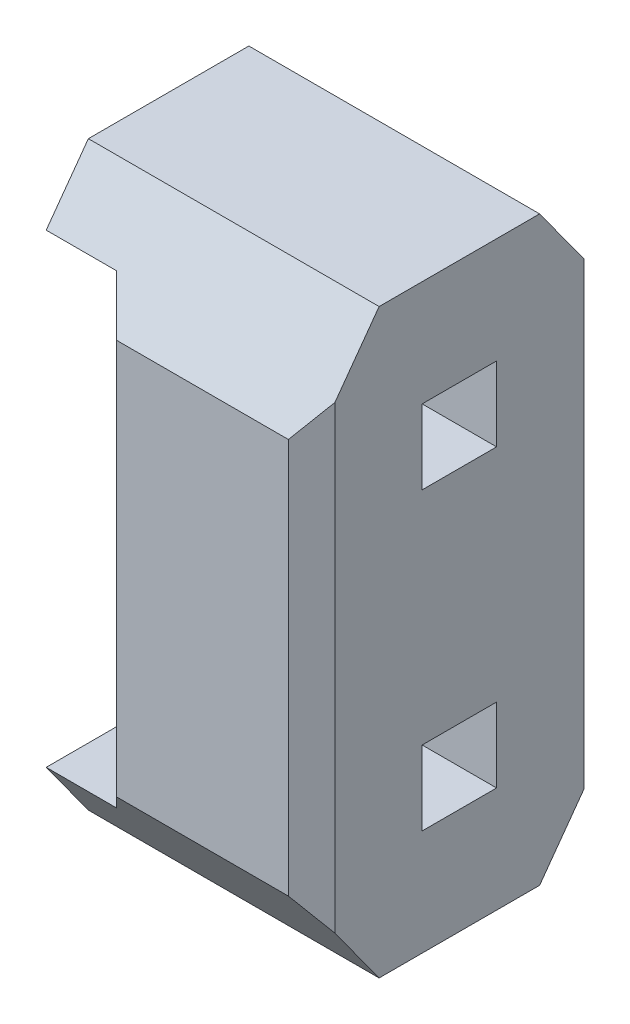
ISO-10303-21;
HEADER;
FILE_DESCRIPTION(('STEP AP214'),'2;1');
FILE_NAME('part.step','',(''),(''),'','','');
FILE_SCHEMA(('AUTOMOTIVE_DESIGN { 1 0 10303 214 1 1 1 1 }'));
ENDSEC;
DATA;
#1=APPLICATION_CONTEXT('core data for automotive mechanical design processes');
#2=APPLICATION_PROTOCOL_DEFINITION('international standard','automotive_design',2000,#1);
#3=PRODUCT_CONTEXT('',#1,'mechanical');
#4=PRODUCT('Part','Part','',(#3));
#5=PRODUCT_RELATED_PRODUCT_CATEGORY('part','',(#4));
#6=PRODUCT_DEFINITION_FORMATION('','',#4);
#7=PRODUCT_DEFINITION_CONTEXT('part definition',#1,'design');
#8=PRODUCT_DEFINITION('design','',#6,#7);
#9=PRODUCT_DEFINITION_SHAPE('','',#8);
#10=(LENGTH_UNIT() NAMED_UNIT(*) SI_UNIT(.MILLI.,.METRE.));
#11=(NAMED_UNIT(*) PLANE_ANGLE_UNIT() SI_UNIT($,.RADIAN.));
#12=(NAMED_UNIT(*) SI_UNIT($,.STERADIAN.) SOLID_ANGLE_UNIT());
#13=UNCERTAINTY_MEASURE_WITH_UNIT(LENGTH_MEASURE(1.E-05),#10,'distance_accuracy_value','');
#14=(GEOMETRIC_REPRESENTATION_CONTEXT(3) GLOBAL_UNCERTAINTY_ASSIGNED_CONTEXT((#13)) GLOBAL_UNIT_ASSIGNED_CONTEXT((#10,
#11,#12)) REPRESENTATION_CONTEXT('',''));
#15=CARTESIAN_POINT('',(0.,0.,0.));
#16=DIRECTION('',(0.,0.,1.));
#17=DIRECTION('',(1.,0.,0.));
#18=AXIS2_PLACEMENT_3D('',#15,#16,#17);
#19=CARTESIAN_POINT('',(1.25,4.6,-15.53));
#20=DIRECTION('',(0.,0.586967571460905,0.809610443394407));
#21=DIRECTION('',(0.,-0.809610443394407,0.586967571460905));
#22=AXIS2_PLACEMENT_3D('',#19,#20,#21);
#23=PLANE('',#22);
#24=DIRECTION('',(1.,0.,0.));
#25=VECTOR('',#24,1.);
#26=CARTESIAN_POINT('',(1.25,4.5,-15.4575));
#27=LINE('',#26,#25);
#28=CARTESIAN_POINT('',(0.,4.5,-15.4575));
#29=VERTEX_POINT('',#28);
#30=CARTESIAN_POINT('',(0.602500000000325,4.5,-15.4575000000001));
#31=VERTEX_POINT('',#30);
#32=EDGE_CURVE('E199',#29,#31,#27,.T.);
#33=ORIENTED_EDGE('',*,*,#32,.T.);
#34=DIRECTION('',(0.506207656348696,-0.698217457033983,0.506207656349604));
#35=VECTOR('',#34,1.);
#36=CARTESIAN_POINT('',(0.6025000000002,4.5,-15.4575));
#37=LINE('',#36,#35);
#38=CARTESIAN_POINT('',(0.819999999999671,4.2,-15.2399999999999));
#39=VERTEX_POINT('',#38);
#40=EDGE_CURVE('E197',#31,#39,#37,.T.);
#41=ORIENTED_EDGE('',*,*,#40,.T.);
#42=DIRECTION('',(1.,0.,0.));
#43=VECTOR('',#42,1.);
#44=CARTESIAN_POINT('',(1.25,4.19999999999999,-15.24));
#45=LINE('',#44,#43);
#46=CARTESIAN_POINT('',(2.30000000000012,4.2,-15.2399999999999));
#47=VERTEX_POINT('',#46);
#48=EDGE_CURVE('E20',#39,#47,#45,.T.);
#49=ORIENTED_EDGE('',*,*,#48,.T.);
#50=DIRECTION('',(0.506207656348956,0.698217457033859,-0.506207656349515));
#51=VECTOR('',#50,1.);
#52=CARTESIAN_POINT('',(2.3,4.19999999999999,-15.24));
#53=LINE('',#52,#51);
#54=CARTESIAN_POINT('',(2.49999999999988,4.47586206896591,-15.4400000000002));
#55=VERTEX_POINT('',#54);
#56=EDGE_CURVE('E181',#47,#55,#53,.T.);
#57=ORIENTED_EDGE('',*,*,#56,.T.);
#58=DIRECTION('',(0.,-0.809610443394407,0.586967571460905));
#59=VECTOR('',#58,1.);
#60=CARTESIAN_POINT('',(2.5,4.6,-15.53));
#61=LINE('',#60,#59);
#62=CARTESIAN_POINT('',(2.5,5.,-15.82));
#63=VERTEX_POINT('',#62);
#64=EDGE_CURVE('E188',#55,#63,#61,.F.);
#65=ORIENTED_EDGE('',*,*,#64,.T.);
#66=DIRECTION('',(1.,0.,0.));
#67=VECTOR('',#66,1.);
#68=CARTESIAN_POINT('',(1.25,5.,-15.82));
#69=LINE('',#68,#67);
#70=CARTESIAN_POINT('',(0.,5.,-15.82));
#71=VERTEX_POINT('',#70);
#72=EDGE_CURVE('E215',#71,#63,#69,.T.);
#73=ORIENTED_EDGE('',*,*,#72,.F.);
#74=DIRECTION('',(0.,-0.809610443394407,0.586967571460905));
#75=VECTOR('',#74,1.);
#76=CARTESIAN_POINT('',(0.,4.6,-15.53));
#77=LINE('',#76,#75);
#78=EDGE_CURVE('E207',#71,#29,#77,.T.);
#79=ORIENTED_EDGE('',*,*,#78,.T.);
#80=EDGE_LOOP('',(#33,#41,#49,#57,#65,#73,#79));
#81=FACE_BOUND('',#80,.T.);
#82=ADVANCED_FACE('F17',(#81),#23,.T.);
#83=CARTESIAN_POINT('',(1.25,4.6,-17.49));
#84=DIRECTION('',(0.,-0.586967571460905,0.809610443394407));
#85=DIRECTION('',(0.,-0.809610443394407,-0.586967571460905));
#86=AXIS2_PLACEMENT_3D('',#83,#84,#85);
#87=PLANE('',#86);
#88=DIRECTION('',(0.,-0.809610443394407,-0.586967571460905));
#89=VECTOR('',#88,1.);
#90=CARTESIAN_POINT('',(0.,4.6,-17.49));
#91=LINE('',#90,#89);
#92=CARTESIAN_POINT('',(0.,5.,-17.2));
#93=VERTEX_POINT('',#92);
#94=CARTESIAN_POINT('',(0.,4.5,-17.5625));
#95=VERTEX_POINT('',#94);
#96=EDGE_CURVE('E263',#93,#95,#91,.T.);
#97=ORIENTED_EDGE('',*,*,#96,.F.);
#98=DIRECTION('',(1.,0.,0.));
#99=VECTOR('',#98,1.);
#100=CARTESIAN_POINT('',(1.25,5.,-17.2));
#101=LINE('',#100,#99);
#102=CARTESIAN_POINT('',(2.5,5.,-17.2));
#103=VERTEX_POINT('',#102);
#104=EDGE_CURVE('E227',#103,#93,#101,.F.);
#105=ORIENTED_EDGE('',*,*,#104,.F.);
#106=DIRECTION('',(0.,-0.809610443394407,-0.586967571460905));
#107=VECTOR('',#106,1.);
#108=CARTESIAN_POINT('',(2.5,4.6,-17.49));
#109=LINE('',#108,#107);
#110=CARTESIAN_POINT('',(2.49999999999988,4.47586206896591,-17.5799999999998));
#111=VERTEX_POINT('',#110);
#112=EDGE_CURVE('E223',#111,#103,#109,.F.);
#113=ORIENTED_EDGE('',*,*,#112,.F.);
#114=DIRECTION('',(0.506207656348955,0.69821745703386,0.506207656349514));
#115=VECTOR('',#114,1.);
#116=CARTESIAN_POINT('',(2.3,4.19999999999999,-17.78));
#117=LINE('',#116,#115);
#118=CARTESIAN_POINT('',(2.30000000000012,4.2,-17.7800000000001));
#119=VERTEX_POINT('',#118);
#120=EDGE_CURVE('E266',#119,#111,#117,.T.);
#121=ORIENTED_EDGE('',*,*,#120,.F.);
#122=DIRECTION('',(1.,0.,0.));
#123=VECTOR('',#122,1.);
#124=CARTESIAN_POINT('',(1.25,4.19999999999999,-17.78));
#125=LINE('',#124,#123);
#126=CARTESIAN_POINT('',(0.819999999999671,4.2,-17.7800000000001));
#127=VERTEX_POINT('',#126);
#128=EDGE_CURVE('E205',#127,#119,#125,.T.);
#129=ORIENTED_EDGE('',*,*,#128,.F.);
#130=DIRECTION('',(0.506207656348694,-0.698217457033983,-0.506207656349606));
#131=VECTOR('',#130,1.);
#132=CARTESIAN_POINT('',(0.6025000000002,4.5,-17.5625));
#133=LINE('',#132,#131);
#134=CARTESIAN_POINT('',(0.602500000000325,4.5,-17.5624999999999));
#135=VERTEX_POINT('',#134);
#136=EDGE_CURVE('E203',#135,#127,#133,.T.);
#137=ORIENTED_EDGE('',*,*,#136,.F.);
#138=DIRECTION('',(1.,0.,0.));
#139=VECTOR('',#138,1.);
#140=CARTESIAN_POINT('',(1.25,4.5,-17.5625));
#141=LINE('',#140,#139);
#142=EDGE_CURVE('E261',#95,#135,#141,.T.);
#143=ORIENTED_EDGE('',*,*,#142,.F.);
#144=EDGE_LOOP('',(#97,#105,#113,#121,#129,#137,#143));
#145=FACE_BOUND('',#144,.T.);
#146=ADVANCED_FACE('F285',(#145),#87,.F.);
#147=CARTESIAN_POINT('',(1.25,0.4,-17.49));
#148=DIRECTION('',(0.,0.586967571460905,0.809610443394407));
#149=DIRECTION('',(0.,-0.809610443394407,0.586967571460905));
#150=AXIS2_PLACEMENT_3D('',#147,#148,#149);
#151=PLANE('',#150);
#152=DIRECTION('',(-0.5062076563494,0.698217457033648,-0.506207656349362));
#153=VECTOR('',#152,1.);
#154=CARTESIAN_POINT('',(2.5,0.524137931034496,-17.58));
#155=LINE('',#154,#153);
#156=CARTESIAN_POINT('',(2.49999999999988,0.524137931034498,-17.5799999999999));
#157=VERTEX_POINT('',#156);
#158=CARTESIAN_POINT('',(2.30000000000012,0.800000000000005,-17.7800000000001));
#159=VERTEX_POINT('',#158);
#160=EDGE_CURVE('E251',#157,#159,#155,.T.);
#161=ORIENTED_EDGE('',*,*,#160,.F.);
#162=DIRECTION('',(0.,-0.809610443394407,0.586967571460905));
#163=VECTOR('',#162,1.);
#164=CARTESIAN_POINT('',(2.5,0.4,-17.49));
#165=LINE('',#164,#163);
#166=CARTESIAN_POINT('',(2.5,0.,-17.2));
#167=VERTEX_POINT('',#166);
#168=EDGE_CURVE('E253',#167,#157,#165,.F.);
#169=ORIENTED_EDGE('',*,*,#168,.F.);
#170=DIRECTION('',(1.,0.,0.));
#171=VECTOR('',#170,1.);
#172=CARTESIAN_POINT('',(1.25,0.,-17.2));
#173=LINE('',#172,#171);
#174=CARTESIAN_POINT('',(0.,0.,-17.2));
#175=VERTEX_POINT('',#174);
#176=EDGE_CURVE('E288',#167,#175,#173,.F.);
#177=ORIENTED_EDGE('',*,*,#176,.T.);
#178=DIRECTION('',(0.,-0.809610443394407,0.586967571460905));
#179=VECTOR('',#178,1.);
#180=CARTESIAN_POINT('',(0.,0.4,-17.49));
#181=LINE('',#180,#179);
#182=CARTESIAN_POINT('',(0.,0.500000000000001,-17.5625));
#183=VERTEX_POINT('',#182);
#184=EDGE_CURVE('E255',#183,#175,#181,.T.);
#185=ORIENTED_EDGE('',*,*,#184,.F.);
#186=DIRECTION('',(1.,0.,0.));
#187=VECTOR('',#186,1.);
#188=CARTESIAN_POINT('',(1.25,0.500000000000003,-17.5625));
#189=LINE('',#188,#187);
#190=CARTESIAN_POINT('',(0.602500000000325,0.500000000000002,-17.5624999999999));
#191=VERTEX_POINT('',#190);
#192=EDGE_CURVE('E257',#191,#183,#189,.F.);
#193=ORIENTED_EDGE('',*,*,#192,.F.);
#194=DIRECTION('',(-0.506207656348694,-0.698217457033983,0.506207656349606));
#195=VECTOR('',#194,1.);
#196=CARTESIAN_POINT('',(0.8199999999998,0.800000000000011,-17.78));
#197=LINE('',#196,#195);
#198=CARTESIAN_POINT('',(0.819999999999671,0.800000000000005,-17.7800000000001));
#199=VERTEX_POINT('',#198);
#200=EDGE_CURVE('E259',#199,#191,#197,.T.);
#201=ORIENTED_EDGE('',*,*,#200,.F.);
#202=DIRECTION('',(1.,0.,0.));
#203=VECTOR('',#202,1.);
#204=CARTESIAN_POINT('',(1.25,0.800000000000011,-17.78));
#205=LINE('',#204,#203);
#206=EDGE_CURVE('E249',#159,#199,#205,.F.);
#207=ORIENTED_EDGE('',*,*,#206,.F.);
#208=EDGE_LOOP('',(#161,#169,#177,#185,#193,#201,#207));
#209=FACE_BOUND('',#208,.T.);
#210=ADVANCED_FACE('F431',(#209),#151,.F.);
#211=CARTESIAN_POINT('',(1.25,0.4,-15.53));
#212=DIRECTION('',(0.,-0.586967571460905,0.809610443394407));
#213=DIRECTION('',(0.,-0.809610443394407,-0.586967571460905));
#214=AXIS2_PLACEMENT_3D('',#211,#212,#213);
#215=PLANE('',#214);
#216=DIRECTION('',(1.,0.,0.));
#217=VECTOR('',#216,1.);
#218=CARTESIAN_POINT('',(1.25,0.800000000000009,-15.24));
#219=LINE('',#218,#217);
#220=CARTESIAN_POINT('',(2.30000000000012,0.800000000000005,-15.2399999999999));
#221=VERTEX_POINT('',#220);
#222=CARTESIAN_POINT('',(0.819999999999671,0.800000000000004,-15.2399999999999));
#223=VERTEX_POINT('',#222);
#224=EDGE_CURVE('E191',#221,#223,#219,.F.);
#225=ORIENTED_EDGE('',*,*,#224,.T.);
#226=DIRECTION('',(-0.506207656348695,-0.698217457033984,-0.506207656349603));
#227=VECTOR('',#226,1.);
#228=CARTESIAN_POINT('',(0.8199999999998,0.800000000000009,-15.24));
#229=LINE('',#228,#227);
#230=CARTESIAN_POINT('',(0.602500000000325,0.500000000000001,-15.4575000000001));
#231=VERTEX_POINT('',#230);
#232=EDGE_CURVE('E232',#223,#231,#229,.T.);
#233=ORIENTED_EDGE('',*,*,#232,.T.);
#234=DIRECTION('',(1.,0.,0.));
#235=VECTOR('',#234,1.);
#236=CARTESIAN_POINT('',(1.25,0.500000000000002,-15.4575));
#237=LINE('',#236,#235);
#238=CARTESIAN_POINT('',(0.,0.500000000000001,-15.4575));
#239=VERTEX_POINT('',#238);
#240=EDGE_CURVE('E246',#231,#239,#237,.F.);
#241=ORIENTED_EDGE('',*,*,#240,.T.);
#242=DIRECTION('',(0.,-0.809610443394407,-0.586967571460905));
#243=VECTOR('',#242,1.);
#244=CARTESIAN_POINT('',(0.,0.4,-15.53));
#245=LINE('',#244,#243);
#246=CARTESIAN_POINT('',(0.,0.,-15.82));
#247=VERTEX_POINT('',#246);
#248=EDGE_CURVE('E244',#239,#247,#245,.T.);
#249=ORIENTED_EDGE('',*,*,#248,.T.);
#250=DIRECTION('',(1.,0.,0.));
#251=VECTOR('',#250,1.);
#252=CARTESIAN_POINT('',(1.25,0.,-15.82));
#253=LINE('',#252,#251);
#254=CARTESIAN_POINT('',(2.5,0.,-15.82));
#255=VERTEX_POINT('',#254);
#256=EDGE_CURVE('E293',#247,#255,#253,.T.);
#257=ORIENTED_EDGE('',*,*,#256,.T.);
#258=DIRECTION('',(0.,-0.809610443394407,-0.586967571460905));
#259=VECTOR('',#258,1.);
#260=CARTESIAN_POINT('',(2.5,0.4,-15.53));
#261=LINE('',#260,#259);
#262=CARTESIAN_POINT('',(2.49999999999988,0.524137931034498,-15.4400000000001));
#263=VERTEX_POINT('',#262);
#264=EDGE_CURVE('E241',#255,#263,#261,.F.);
#265=ORIENTED_EDGE('',*,*,#264,.T.);
#266=DIRECTION('',(-0.506207656349403,0.698217457033647,0.50620765634936));
#267=VECTOR('',#266,1.);
#268=CARTESIAN_POINT('',(2.5,0.524137931034496,-15.44));
#269=LINE('',#268,#267);
#270=EDGE_CURVE('E239',#263,#221,#269,.T.);
#271=ORIENTED_EDGE('',*,*,#270,.T.);
#272=EDGE_LOOP('',(#225,#233,#241,#249,#257,#265,#271));
#273=FACE_BOUND('',#272,.T.);
#274=ADVANCED_FACE('F421',(#273),#215,.T.);
#275=CARTESIAN_POINT('',(1.25,5.,-16.51));
#276=DIRECTION('',(0.,1.,0.));
#277=DIRECTION('',(0.,0.,1.));
#278=AXIS2_PLACEMENT_3D('',#275,#276,#277);
#279=PLANE('',#278);
#280=ORIENTED_EDGE('',*,*,#104,.T.);
#281=DIRECTION('',(0.,0.,-1.));
#282=VECTOR('',#281,1.);
#283=CARTESIAN_POINT('',(0.,5.,-16.51));
#284=LINE('',#283,#282);
#285=EDGE_CURVE('E231',#93,#71,#284,.F.);
#286=ORIENTED_EDGE('',*,*,#285,.T.);
#287=ORIENTED_EDGE('',*,*,#72,.T.);
#288=DIRECTION('',(0.,0.,1.));
#289=VECTOR('',#288,1.);
#290=CARTESIAN_POINT('',(2.5,5.,-16.51));
#291=LINE('',#290,#289);
#292=EDGE_CURVE('E219',#63,#103,#291,.F.);
#293=ORIENTED_EDGE('',*,*,#292,.T.);
#294=EDGE_LOOP('',(#280,#286,#287,#293));
#295=FACE_BOUND('',#294,.T.);
#296=ADVANCED_FACE('F229',(#295),#279,.T.);
#297=CARTESIAN_POINT('',(1.25,0.,-16.51));
#298=DIRECTION('',(0.,1.,0.));
#299=DIRECTION('',(0.,0.,1.));
#300=AXIS2_PLACEMENT_3D('',#297,#298,#299);
#301=PLANE('',#300);
#302=DIRECTION('',(0.,0.,-1.));
#303=VECTOR('',#302,1.);
#304=CARTESIAN_POINT('',(0.,0.,-16.51));
#305=LINE('',#304,#303);
#306=EDGE_CURVE('E297',#247,#175,#305,.T.);
#307=ORIENTED_EDGE('',*,*,#306,.T.);
#308=ORIENTED_EDGE('',*,*,#176,.F.);
#309=DIRECTION('',(0.,0.,1.));
#310=VECTOR('',#309,1.);
#311=CARTESIAN_POINT('',(2.5,0.,-16.51));
#312=LINE('',#311,#310);
#313=EDGE_CURVE('E287',#255,#167,#312,.F.);
#314=ORIENTED_EDGE('',*,*,#313,.F.);
#315=ORIENTED_EDGE('',*,*,#256,.F.);
#316=EDGE_LOOP('',(#307,#308,#314,#315));
#317=FACE_BOUND('',#316,.T.);
#318=ADVANCED_FACE('F428',(#317),#301,.F.);
#319=CARTESIAN_POINT('',(0.,4.75,-16.51));
#320=DIRECTION('',(1.,0.,0.));
#321=DIRECTION('',(0.,0.,-1.));
#322=AXIS2_PLACEMENT_3D('',#319,#320,#321);
#323=PLANE('',#322);
#324=ORIENTED_EDGE('',*,*,#285,.F.);
#325=ORIENTED_EDGE('',*,*,#96,.T.);
#326=DIRECTION('',(0.,0.,1.));
#327=VECTOR('',#326,1.);
#328=CARTESIAN_POINT('',(0.,4.5,-16.51));
#329=LINE('',#328,#327);
#330=EDGE_CURVE('E307',#95,#29,#329,.T.);
#331=ORIENTED_EDGE('',*,*,#330,.T.);
#332=ORIENTED_EDGE('',*,*,#78,.F.);
#333=EDGE_LOOP('',(#324,#325,#331,#332));
#334=FACE_BOUND('',#333,.T.);
#335=ADVANCED_FACE('F441',(#334),#323,.F.);
#336=CARTESIAN_POINT('',(0.,0.25,-16.51));
#337=DIRECTION('',(1.,0.,0.));
#338=DIRECTION('',(0.,0.,-1.));
#339=AXIS2_PLACEMENT_3D('',#336,#337,#338);
#340=PLANE('',#339);
#341=ORIENTED_EDGE('',*,*,#306,.F.);
#342=ORIENTED_EDGE('',*,*,#248,.F.);
#343=DIRECTION('',(0.,0.,1.));
#344=VECTOR('',#343,1.);
#345=CARTESIAN_POINT('',(0.,0.5,-16.51));
#346=LINE('',#345,#344);
#347=EDGE_CURVE('E315',#183,#239,#346,.T.);
#348=ORIENTED_EDGE('',*,*,#347,.F.);
#349=ORIENTED_EDGE('',*,*,#184,.T.);
#350=EDGE_LOOP('',(#341,#342,#348,#349));
#351=FACE_BOUND('',#350,.T.);
#352=ADVANCED_FACE('F443',(#351),#340,.F.);
#353=CARTESIAN_POINT('',(1.55,3.45,-16.51));
#354=DIRECTION('',(0.,1.,0.));
#355=DIRECTION('',(0.,0.,1.));
#356=AXIS2_PLACEMENT_3D('',#353,#354,#355);
#357=PLANE('',#356);
#358=DIRECTION('',(1.,0.,0.));
#359=VECTOR('',#358,1.);
#360=CARTESIAN_POINT('',(1.55,3.45,-16.83));
#361=LINE('',#360,#359);
#362=CARTESIAN_POINT('',(0.6,3.45,-16.83));
#363=VERTEX_POINT('',#362);
#364=CARTESIAN_POINT('',(2.5,3.45,-16.83));
#365=VERTEX_POINT('',#364);
#366=EDGE_CURVE('E332',#363,#365,#361,.T.);
#367=ORIENTED_EDGE('',*,*,#366,.F.);
#368=DIRECTION('',(0.,0.,1.));
#369=VECTOR('',#368,1.);
#370=CARTESIAN_POINT('',(0.6,3.45,-16.51));
#371=LINE('',#370,#369);
#372=CARTESIAN_POINT('',(0.6,3.45,-16.19));
#373=VERTEX_POINT('',#372);
#374=EDGE_CURVE('E302',#363,#373,#371,.T.);
#375=ORIENTED_EDGE('',*,*,#374,.T.);
#376=DIRECTION('',(1.,0.,0.));
#377=VECTOR('',#376,1.);
#378=CARTESIAN_POINT('',(1.55,3.45,-16.19));
#379=LINE('',#378,#377);
#380=CARTESIAN_POINT('',(2.5,3.45,-16.19));
#381=VERTEX_POINT('',#380);
#382=EDGE_CURVE('E327',#373,#381,#379,.T.);
#383=ORIENTED_EDGE('',*,*,#382,.T.);
#384=DIRECTION('',(0.,0.,1.));
#385=VECTOR('',#384,1.);
#386=CARTESIAN_POINT('',(2.5,3.45,-16.51));
#387=LINE('',#386,#385);
#388=EDGE_CURVE('E300',#381,#365,#387,.F.);
#389=ORIENTED_EDGE('',*,*,#388,.T.);
#390=EDGE_LOOP('',(#367,#375,#383,#389));
#391=FACE_BOUND('',#390,.T.);
#392=ADVANCED_FACE('F398',(#391),#357,.T.);
#393=CARTESIAN_POINT('',(0.71,2.5,-17.67));
#394=DIRECTION('',(0.707106781190498,0.,0.707106781182598));
#395=DIRECTION('',(0.707106781182598,0.,-0.707106781190498));
#396=AXIS2_PLACEMENT_3D('',#393,#394,#395);
#397=PLANE('',#396);
#398=ORIENTED_EDGE('',*,*,#200,.T.);
#399=DIRECTION('',(0.70710678118618,0.,-0.707106781186916));
#400=VECTOR('',#399,1.);
#401=CARTESIAN_POINT('',(0.6000000000002,0.5,-17.56));
#402=LINE('',#401,#400);
#403=CARTESIAN_POINT('',(0.600000000000407,0.5,-17.5599999999997));
#404=VERTEX_POINT('',#403);
#405=EDGE_CURVE('E312',#404,#191,#402,.T.);
#406=ORIENTED_EDGE('',*,*,#405,.F.);
#407=DIRECTION('',(0.,1.,0.));
#408=VECTOR('',#407,1.);
#409=CARTESIAN_POINT('',(0.6,2.5,-17.56));
#410=LINE('',#409,#408);
#411=CARTESIAN_POINT('',(0.600000000000407,4.5,-17.5599999999997));
#412=VERTEX_POINT('',#411);
#413=EDGE_CURVE('E337',#404,#412,#410,.T.);
#414=ORIENTED_EDGE('',*,*,#413,.T.);
#415=DIRECTION('',(0.70710678118618,0.,-0.707106781186916));
#416=VECTOR('',#415,1.);
#417=CARTESIAN_POINT('',(0.6000000000002,4.5,-17.56));
#418=LINE('',#417,#416);
#419=EDGE_CURVE('E304',#412,#135,#418,.T.);
#420=ORIENTED_EDGE('',*,*,#419,.T.);
#421=ORIENTED_EDGE('',*,*,#136,.T.);
#422=DIRECTION('',(0.,1.,0.));
#423=VECTOR('',#422,1.);
#424=CARTESIAN_POINT('',(0.8199999999998,2.5,-17.78));
#425=LINE('',#424,#423);
#426=EDGE_CURVE('E275',#127,#199,#425,.F.);
#427=ORIENTED_EDGE('',*,*,#426,.T.);
#428=EDGE_LOOP('',(#398,#406,#414,#420,#421,#427));
#429=FACE_BOUND('',#428,.T.);
#430=ADVANCED_FACE('F435',(#429),#397,.F.);
#431=CARTESIAN_POINT('',(0.30125,4.5,-16.51));
#432=DIRECTION('',(0.,1.,0.));
#433=DIRECTION('',(0.,0.,1.));
#434=AXIS2_PLACEMENT_3D('',#431,#432,#433);
#435=PLANE('',#434);
#436=ORIENTED_EDGE('',*,*,#142,.T.);
#437=ORIENTED_EDGE('',*,*,#419,.F.);
#438=DIRECTION('',(0.,0.,-1.));
#439=VECTOR('',#438,1.);
#440=CARTESIAN_POINT('',(0.6,4.5,-16.51));
#441=LINE('',#440,#439);
#442=CARTESIAN_POINT('',(0.600000000000279,4.5,-15.4600000000001));
#443=VERTEX_POINT('',#442);
#444=EDGE_CURVE('E339',#412,#443,#441,.F.);
#445=ORIENTED_EDGE('',*,*,#444,.T.);
#446=DIRECTION('',(-0.707106781182598,0.,-0.707106781190498));
#447=VECTOR('',#446,1.);
#448=CARTESIAN_POINT('',(0.71,4.5,-15.35));
#449=LINE('',#448,#447);
#450=EDGE_CURVE('E310',#443,#31,#449,.F.);
#451=ORIENTED_EDGE('',*,*,#450,.T.);
#452=ORIENTED_EDGE('',*,*,#32,.F.);
#453=ORIENTED_EDGE('',*,*,#330,.F.);
#454=EDGE_LOOP('',(#436,#437,#445,#451,#452,#453));
#455=FACE_BOUND('',#454,.T.);
#456=ADVANCED_FACE('F439',(#455),#435,.F.);
#457=CARTESIAN_POINT('',(0.71,2.5,-15.35));
#458=DIRECTION('',(0.707106781190498,0.,-0.707106781182598));
#459=DIRECTION('',(-0.707106781182598,0.,-0.707106781190498));
#460=AXIS2_PLACEMENT_3D('',#457,#458,#459);
#461=PLANE('',#460);
#462=ORIENTED_EDGE('',*,*,#232,.F.);
#463=DIRECTION('',(0.,1.,0.));
#464=VECTOR('',#463,1.);
#465=CARTESIAN_POINT('',(0.8199999999998,2.5,-15.24));
#466=LINE('',#465,#464);
#467=EDGE_CURVE('E325',#39,#223,#466,.F.);
#468=ORIENTED_EDGE('',*,*,#467,.F.);
#469=ORIENTED_EDGE('',*,*,#40,.F.);
#470=ORIENTED_EDGE('',*,*,#450,.F.);
#471=DIRECTION('',(0.,1.,0.));
#472=VECTOR('',#471,1.);
#473=CARTESIAN_POINT('',(0.6,2.5,-15.46));
#474=LINE('',#473,#472);
#475=CARTESIAN_POINT('',(0.600000000000407,0.5,-15.4600000000003));
#476=VERTEX_POINT('',#475);
#477=EDGE_CURVE('E341',#443,#476,#474,.F.);
#478=ORIENTED_EDGE('',*,*,#477,.T.);
#479=DIRECTION('',(-0.707106781186425,0.,-0.70710678118667));
#480=VECTOR('',#479,1.);
#481=CARTESIAN_POINT('',(0.6025000000002,0.5,-15.4575));
#482=LINE('',#481,#480);
#483=EDGE_CURVE('E318',#231,#476,#482,.T.);
#484=ORIENTED_EDGE('',*,*,#483,.F.);
#485=EDGE_LOOP('',(#462,#468,#469,#470,#478,#484));
#486=FACE_BOUND('',#485,.T.);
#487=ADVANCED_FACE('F416',(#486),#461,.F.);
#488=CARTESIAN_POINT('',(0.30125,0.5,-16.51));
#489=DIRECTION('',(0.,1.,0.));
#490=DIRECTION('',(0.,0.,1.));
#491=AXIS2_PLACEMENT_3D('',#488,#489,#490);
#492=PLANE('',#491);
#493=ORIENTED_EDGE('',*,*,#483,.T.);
#494=DIRECTION('',(0.,0.,-1.));
#495=VECTOR('',#494,1.);
#496=CARTESIAN_POINT('',(0.6,0.5,-16.51));
#497=LINE('',#496,#495);
#498=EDGE_CURVE('E343',#476,#404,#497,.T.);
#499=ORIENTED_EDGE('',*,*,#498,.T.);
#500=ORIENTED_EDGE('',*,*,#405,.T.);
#501=ORIENTED_EDGE('',*,*,#192,.T.);
#502=ORIENTED_EDGE('',*,*,#347,.T.);
#503=ORIENTED_EDGE('',*,*,#240,.F.);
#504=EDGE_LOOP('',(#493,#499,#500,#501,#502,#503));
#505=FACE_BOUND('',#504,.T.);
#506=ADVANCED_FACE('F418',(#505),#492,.T.);
#507=CARTESIAN_POINT('',(1.55,1.23,-16.83));
#508=DIRECTION('',(0.,0.,1.));
#509=DIRECTION('',(1.,0.,0.));
#510=AXIS2_PLACEMENT_3D('',#507,#508,#509);
#511=PLANE('',#510);
#512=DIRECTION('',(1.,0.,0.));
#513=VECTOR('',#512,1.);
#514=CARTESIAN_POINT('',(1.55,1.55,-16.83));
#515=LINE('',#514,#513);
#516=CARTESIAN_POINT('',(2.5,1.55,-16.83));
#517=VERTEX_POINT('',#516);
#518=CARTESIAN_POINT('',(0.6,1.55,-16.83));
#519=VERTEX_POINT('',#518);
#520=EDGE_CURVE('E283',#517,#519,#515,.F.);
#521=ORIENTED_EDGE('',*,*,#520,.T.);
#522=DIRECTION('',(0.,1.,0.));
#523=VECTOR('',#522,1.);
#524=CARTESIAN_POINT('',(0.6,2.5,-16.83));
#525=LINE('',#524,#523);
#526=CARTESIAN_POINT('',(0.6,0.91,-16.83));
#527=VERTEX_POINT('',#526);
#528=EDGE_CURVE('E346',#519,#527,#525,.F.);
#529=ORIENTED_EDGE('',*,*,#528,.T.);
#530=DIRECTION('',(1.,0.,0.));
#531=VECTOR('',#530,1.);
#532=CARTESIAN_POINT('',(1.55,0.91,-16.83));
#533=LINE('',#532,#531);
#534=CARTESIAN_POINT('',(2.5,0.91,-16.83));
#535=VERTEX_POINT('',#534);
#536=EDGE_CURVE('E354',#535,#527,#533,.F.);
#537=ORIENTED_EDGE('',*,*,#536,.F.);
#538=DIRECTION('',(0.,1.,0.));
#539=VECTOR('',#538,1.);
#540=CARTESIAN_POINT('',(2.5,1.23,-16.83));
#541=LINE('',#540,#539);
#542=EDGE_CURVE('E321',#535,#517,#541,.T.);
#543=ORIENTED_EDGE('',*,*,#542,.T.);
#544=EDGE_LOOP('',(#521,#529,#537,#543));
#545=FACE_BOUND('',#544,.T.);
#546=ADVANCED_FACE('F483',(#545),#511,.T.);
#547=CARTESIAN_POINT('',(1.56,2.5,-17.78));
#548=DIRECTION('',(0.,0.,1.));
#549=DIRECTION('',(1.,0.,0.));
#550=AXIS2_PLACEMENT_3D('',#547,#548,#549);
#551=PLANE('',#550);
#552=DIRECTION('',(0.,1.,0.));
#553=VECTOR('',#552,1.);
#554=CARTESIAN_POINT('',(2.30000000000047,2.5,-17.7800000000005));
#555=LINE('',#554,#553);
#556=EDGE_CURVE('E193',#159,#119,#555,.T.);
#557=ORIENTED_EDGE('',*,*,#556,.F.);
#558=ORIENTED_EDGE('',*,*,#206,.T.);
#559=ORIENTED_EDGE('',*,*,#426,.F.);
#560=ORIENTED_EDGE('',*,*,#128,.T.);
#561=EDGE_LOOP('',(#557,#558,#559,#560));
#562=FACE_BOUND('',#561,.T.);
#563=ADVANCED_FACE('F272',(#562),#551,.F.);
#564=CARTESIAN_POINT('',(1.56,2.5,-15.24));
#565=DIRECTION('',(0.,0.,1.));
#566=DIRECTION('',(1.,0.,0.));
#567=AXIS2_PLACEMENT_3D('',#564,#565,#566);
#568=PLANE('',#567);
#569=ORIENTED_EDGE('',*,*,#48,.F.);
#570=ORIENTED_EDGE('',*,*,#467,.T.);
#571=ORIENTED_EDGE('',*,*,#224,.F.);
#572=DIRECTION('',(0.,1.,0.));
#573=VECTOR('',#572,1.);
#574=CARTESIAN_POINT('',(2.30000000000047,2.5,-15.2399999999995));
#575=LINE('',#574,#573);
#576=EDGE_CURVE('E183',#47,#221,#575,.F.);
#577=ORIENTED_EDGE('',*,*,#576,.F.);
#578=EDGE_LOOP('',(#569,#570,#571,#577));
#579=FACE_BOUND('',#578,.T.);
#580=ADVANCED_FACE('F189',(#579),#568,.T.);
#581=CARTESIAN_POINT('',(1.55,3.77,-16.19));
#582=DIRECTION('',(0.,0.,1.));
#583=DIRECTION('',(1.,0.,0.));
#584=AXIS2_PLACEMENT_3D('',#581,#582,#583);
#585=PLANE('',#584);
#586=DIRECTION('',(0.,1.,0.));
#587=VECTOR('',#586,1.);
#588=CARTESIAN_POINT('',(2.5,3.77,-16.19));
#589=LINE('',#588,#587);
#590=CARTESIAN_POINT('',(2.5,4.09,-16.19));
#591=VERTEX_POINT('',#590);
#592=EDGE_CURVE('E330',#381,#591,#589,.T.);
#593=ORIENTED_EDGE('',*,*,#592,.F.);
#594=ORIENTED_EDGE('',*,*,#382,.F.);
#595=DIRECTION('',(0.,1.,0.));
#596=VECTOR('',#595,1.);
#597=CARTESIAN_POINT('',(0.6,2.5,-16.19));
#598=LINE('',#597,#596);
#599=CARTESIAN_POINT('',(0.6,4.09,-16.19));
#600=VERTEX_POINT('',#599);
#601=EDGE_CURVE('E351',#373,#600,#598,.T.);
#602=ORIENTED_EDGE('',*,*,#601,.T.);
#603=DIRECTION('',(1.,0.,0.));
#604=VECTOR('',#603,1.);
#605=CARTESIAN_POINT('',(1.55,4.09,-16.19));
#606=LINE('',#605,#604);
#607=EDGE_CURVE('E368',#600,#591,#606,.T.);
#608=ORIENTED_EDGE('',*,*,#607,.T.);
#609=EDGE_LOOP('',(#593,#594,#602,#608));
#610=FACE_BOUND('',#609,.T.);
#611=ADVANCED_FACE('F402',(#610),#585,.F.);
#612=CARTESIAN_POINT('',(1.55,3.77,-16.83));
#613=DIRECTION('',(0.,0.,1.));
#614=DIRECTION('',(1.,0.,0.));
#615=AXIS2_PLACEMENT_3D('',#612,#613,#614);
#616=PLANE('',#615);
#617=DIRECTION('',(1.,0.,0.));
#618=VECTOR('',#617,1.);
#619=CARTESIAN_POINT('',(1.55,4.09,-16.83));
#620=LINE('',#619,#618);
#621=CARTESIAN_POINT('',(2.5,4.09,-16.83));
#622=VERTEX_POINT('',#621);
#623=CARTESIAN_POINT('',(0.6,4.09,-16.83));
#624=VERTEX_POINT('',#623);
#625=EDGE_CURVE('E371',#622,#624,#620,.F.);
#626=ORIENTED_EDGE('',*,*,#625,.T.);
#627=DIRECTION('',(0.,1.,0.));
#628=VECTOR('',#627,1.);
#629=CARTESIAN_POINT('',(0.6,2.5,-16.83));
#630=LINE('',#629,#628);
#631=EDGE_CURVE('E348',#624,#363,#630,.F.);
#632=ORIENTED_EDGE('',*,*,#631,.T.);
#633=ORIENTED_EDGE('',*,*,#366,.T.);
#634=DIRECTION('',(0.,1.,0.));
#635=VECTOR('',#634,1.);
#636=CARTESIAN_POINT('',(2.5,3.77,-16.83));
#637=LINE('',#636,#635);
#638=EDGE_CURVE('E335',#365,#622,#637,.T.);
#639=ORIENTED_EDGE('',*,*,#638,.T.);
#640=EDGE_LOOP('',(#626,#632,#633,#639));
#641=FACE_BOUND('',#640,.T.);
#642=ADVANCED_FACE('F395',(#641),#616,.T.);
#643=CARTESIAN_POINT('',(0.6,2.5,-16.51));
#644=DIRECTION('',(1.,0.,0.));
#645=DIRECTION('',(0.,0.,-1.));
#646=AXIS2_PLACEMENT_3D('',#643,#644,#645);
#647=PLANE('',#646);
#648=ORIENTED_EDGE('',*,*,#374,.F.);
#649=ORIENTED_EDGE('',*,*,#631,.F.);
#650=DIRECTION('',(0.,0.,1.));
#651=VECTOR('',#650,1.);
#652=CARTESIAN_POINT('',(0.6,4.09,-16.51));
#653=LINE('',#652,#651);
#654=EDGE_CURVE('E192',#624,#600,#653,.T.);
#655=ORIENTED_EDGE('',*,*,#654,.T.);
#656=ORIENTED_EDGE('',*,*,#601,.F.);
#657=EDGE_LOOP('',(#648,#649,#655,#656));
#658=FACE_BOUND('',#657,.T.);
#659=ORIENTED_EDGE('',*,*,#528,.F.);
#660=DIRECTION('',(0.,0.,1.));
#661=VECTOR('',#660,1.);
#662=CARTESIAN_POINT('',(0.6,1.55,-16.51));
#663=LINE('',#662,#661);
#664=CARTESIAN_POINT('',(0.6,1.55,-16.19));
#665=VERTEX_POINT('',#664);
#666=EDGE_CURVE('E360',#519,#665,#663,.T.);
#667=ORIENTED_EDGE('',*,*,#666,.T.);
#668=DIRECTION('',(0.,1.,0.));
#669=VECTOR('',#668,1.);
#670=CARTESIAN_POINT('',(0.6,1.23,-16.19));
#671=LINE('',#670,#669);
#672=CARTESIAN_POINT('',(0.6,0.91,-16.19));
#673=VERTEX_POINT('',#672);
#674=EDGE_CURVE('E374',#665,#673,#671,.F.);
#675=ORIENTED_EDGE('',*,*,#674,.T.);
#676=DIRECTION('',(0.,0.,1.));
#677=VECTOR('',#676,1.);
#678=CARTESIAN_POINT('',(0.6,0.91,-16.51));
#679=LINE('',#678,#677);
#680=EDGE_CURVE('E357',#527,#673,#679,.T.);
#681=ORIENTED_EDGE('',*,*,#680,.F.);
#682=EDGE_LOOP('',(#659,#667,#675,#681));
#683=FACE_BOUND('',#682,.T.);
#684=ORIENTED_EDGE('',*,*,#477,.F.);
#685=ORIENTED_EDGE('',*,*,#444,.F.);
#686=ORIENTED_EDGE('',*,*,#413,.F.);
#687=ORIENTED_EDGE('',*,*,#498,.F.);
#688=EDGE_LOOP('',(#684,#685,#686,#687));
#689=FACE_BOUND('',#688,.T.);
#690=ADVANCED_FACE('F404',(#658,#683,#689),#647,.F.);
#691=CARTESIAN_POINT('',(1.55,0.91,-16.51));
#692=DIRECTION('',(0.,1.,0.));
#693=DIRECTION('',(0.,0.,1.));
#694=AXIS2_PLACEMENT_3D('',#691,#692,#693);
#695=PLANE('',#694);
#696=ORIENTED_EDGE('',*,*,#536,.T.);
#697=ORIENTED_EDGE('',*,*,#680,.T.);
#698=DIRECTION('',(1.,0.,0.));
#699=VECTOR('',#698,1.);
#700=CARTESIAN_POINT('',(1.55,0.91,-16.19));
#701=LINE('',#700,#699);
#702=CARTESIAN_POINT('',(2.5,0.91,-16.19));
#703=VERTEX_POINT('',#702);
#704=EDGE_CURVE('E376',#673,#703,#701,.T.);
#705=ORIENTED_EDGE('',*,*,#704,.T.);
#706=DIRECTION('',(0.,0.,1.));
#707=VECTOR('',#706,1.);
#708=CARTESIAN_POINT('',(2.5,0.91,-16.51));
#709=LINE('',#708,#707);
#710=EDGE_CURVE('E34',#703,#535,#709,.F.);
#711=ORIENTED_EDGE('',*,*,#710,.T.);
#712=EDGE_LOOP('',(#696,#697,#705,#711));
#713=FACE_BOUND('',#712,.T.);
#714=ADVANCED_FACE('F407',(#713),#695,.T.);
#715=CARTESIAN_POINT('',(1.55,1.55,-16.51));
#716=DIRECTION('',(0.,1.,0.));
#717=DIRECTION('',(0.,0.,1.));
#718=AXIS2_PLACEMENT_3D('',#715,#716,#717);
#719=PLANE('',#718);
#720=DIRECTION('',(0.,0.,1.));
#721=VECTOR('',#720,1.);
#722=CARTESIAN_POINT('',(2.5,1.55,-16.51));
#723=LINE('',#722,#721);
#724=CARTESIAN_POINT('',(2.5,1.55,-16.19));
#725=VERTEX_POINT('',#724);
#726=EDGE_CURVE('E362',#725,#517,#723,.F.);
#727=ORIENTED_EDGE('',*,*,#726,.F.);
#728=DIRECTION('',(1.,0.,0.));
#729=VECTOR('',#728,1.);
#730=CARTESIAN_POINT('',(1.55,1.55,-16.19));
#731=LINE('',#730,#729);
#732=EDGE_CURVE('E378',#725,#665,#731,.F.);
#733=ORIENTED_EDGE('',*,*,#732,.T.);
#734=ORIENTED_EDGE('',*,*,#666,.F.);
#735=ORIENTED_EDGE('',*,*,#520,.F.);
#736=EDGE_LOOP('',(#727,#733,#734,#735));
#737=FACE_BOUND('',#736,.T.);
#738=ADVANCED_FACE('F468',(#737),#719,.F.);
#739=CARTESIAN_POINT('',(2.4,2.5,-17.68));
#740=DIRECTION('',(0.707106781189898,0.,-0.707106781183198));
#741=DIRECTION('',(-0.707106781183198,0.,-0.707106781189898));
#742=AXIS2_PLACEMENT_3D('',#739,#740,#741);
#743=PLANE('',#742);
#744=DIRECTION('',(0.,1.,0.));
#745=VECTOR('',#744,1.);
#746=CARTESIAN_POINT('',(2.5,2.5,-17.58));
#747=LINE('',#746,#745);
#748=EDGE_CURVE('E381',#157,#111,#747,.T.);
#749=ORIENTED_EDGE('',*,*,#748,.F.);
#750=ORIENTED_EDGE('',*,*,#160,.T.);
#751=ORIENTED_EDGE('',*,*,#556,.T.);
#752=ORIENTED_EDGE('',*,*,#120,.T.);
#753=EDGE_LOOP('',(#749,#750,#751,#752));
#754=FACE_BOUND('',#753,.T.);
#755=ADVANCED_FACE('F281',(#754),#743,.T.);
#756=CARTESIAN_POINT('',(2.4,2.5,-15.34));
#757=DIRECTION('',(0.707106781189898,0.,0.707106781183198));
#758=DIRECTION('',(0.707106781183198,0.,-0.707106781189898));
#759=AXIS2_PLACEMENT_3D('',#756,#757,#758);
#760=PLANE('',#759);
#761=DIRECTION('',(0.,1.,0.));
#762=VECTOR('',#761,1.);
#763=CARTESIAN_POINT('',(2.5,2.5,-15.44));
#764=LINE('',#763,#762);
#765=EDGE_CURVE('E186',#55,#263,#764,.F.);
#766=ORIENTED_EDGE('',*,*,#765,.F.);
#767=ORIENTED_EDGE('',*,*,#56,.F.);
#768=ORIENTED_EDGE('',*,*,#576,.T.);
#769=ORIENTED_EDGE('',*,*,#270,.F.);
#770=EDGE_LOOP('',(#766,#767,#768,#769));
#771=FACE_BOUND('',#770,.T.);
#772=ADVANCED_FACE('F182',(#771),#760,.T.);
#773=CARTESIAN_POINT('',(1.55,4.09,-16.51));
#774=DIRECTION('',(0.,1.,0.));
#775=DIRECTION('',(0.,0.,1.));
#776=AXIS2_PLACEMENT_3D('',#773,#774,#775);
#777=PLANE('',#776);
#778=DIRECTION('',(0.,0.,-1.));
#779=VECTOR('',#778,1.);
#780=CARTESIAN_POINT('',(2.5,4.09,-16.51));
#781=LINE('',#780,#779);
#782=EDGE_CURVE('E26',#591,#622,#781,.T.);
#783=ORIENTED_EDGE('',*,*,#782,.F.);
#784=ORIENTED_EDGE('',*,*,#607,.F.);
#785=ORIENTED_EDGE('',*,*,#654,.F.);
#786=ORIENTED_EDGE('',*,*,#625,.F.);
#787=EDGE_LOOP('',(#783,#784,#785,#786));
#788=FACE_BOUND('',#787,.T.);
#789=ADVANCED_FACE('F392',(#788),#777,.F.);
#790=CARTESIAN_POINT('',(1.55,1.23,-16.19));
#791=DIRECTION('',(0.,0.,1.));
#792=DIRECTION('',(1.,0.,0.));
#793=AXIS2_PLACEMENT_3D('',#790,#791,#792);
#794=PLANE('',#793);
#795=DIRECTION('',(0.,1.,0.));
#796=VECTOR('',#795,1.);
#797=CARTESIAN_POINT('',(2.5,2.5,-16.19));
#798=LINE('',#797,#796);
#799=EDGE_CURVE('E11',#703,#725,#798,.T.);
#800=ORIENTED_EDGE('',*,*,#799,.F.);
#801=ORIENTED_EDGE('',*,*,#704,.F.);
#802=ORIENTED_EDGE('',*,*,#674,.F.);
#803=ORIENTED_EDGE('',*,*,#732,.F.);
#804=EDGE_LOOP('',(#800,#801,#802,#803));
#805=FACE_BOUND('',#804,.T.);
#806=ADVANCED_FACE('F454',(#805),#794,.F.);
#807=CARTESIAN_POINT('',(2.5,2.5,-16.51));
#808=DIRECTION('',(1.,0.,0.));
#809=DIRECTION('',(0.,0.,-1.));
#810=AXIS2_PLACEMENT_3D('',#807,#808,#809);
#811=PLANE('',#810);
#812=ORIENTED_EDGE('',*,*,#710,.F.);
#813=ORIENTED_EDGE('',*,*,#799,.T.);
#814=ORIENTED_EDGE('',*,*,#726,.T.);
#815=ORIENTED_EDGE('',*,*,#542,.F.);
#816=EDGE_LOOP('',(#812,#813,#814,#815));
#817=FACE_BOUND('',#816,.T.);
#818=ORIENTED_EDGE('',*,*,#592,.T.);
#819=ORIENTED_EDGE('',*,*,#782,.T.);
#820=ORIENTED_EDGE('',*,*,#638,.F.);
#821=ORIENTED_EDGE('',*,*,#388,.F.);
#822=EDGE_LOOP('',(#818,#819,#820,#821));
#823=FACE_BOUND('',#822,.T.);
#824=ORIENTED_EDGE('',*,*,#64,.F.);
#825=ORIENTED_EDGE('',*,*,#765,.T.);
#826=ORIENTED_EDGE('',*,*,#264,.F.);
#827=ORIENTED_EDGE('',*,*,#313,.T.);
#828=ORIENTED_EDGE('',*,*,#168,.T.);
#829=ORIENTED_EDGE('',*,*,#748,.T.);
#830=ORIENTED_EDGE('',*,*,#112,.T.);
#831=ORIENTED_EDGE('',*,*,#292,.F.);
#832=EDGE_LOOP('',(#824,#825,#826,#827,#828,#829,#830,#831));
#833=FACE_BOUND('',#832,.T.);
#834=ADVANCED_FACE('F220',(#817,#823,#833),#811,.T.);
#835=CLOSED_SHELL('',(#82,#146,#210,#274,#296,#318,#335,#352,#392,#430,#456,#487,#506,#546,#563,
#580,#611,#642,#690,#714,#738,#755,#772,#789,#806,#834));
#836=MANIFOLD_SOLID_BREP('B1',#835);
#837=ADVANCED_BREP_SHAPE_REPRESENTATION('',(#18,#836),#14);
#838=SHAPE_DEFINITION_REPRESENTATION(#9,#837);
ENDSEC;
END-ISO-10303-21;
